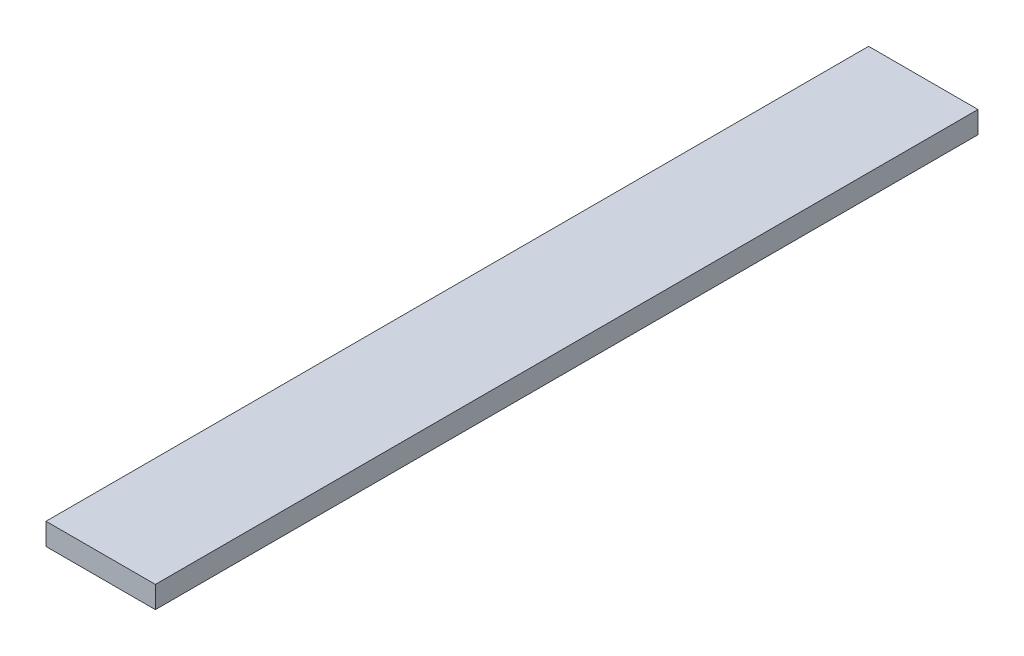
ISO-10303-21;
HEADER;
FILE_DESCRIPTION(('STEP AP214'),'2;1');
FILE_NAME('part.step','',(''),(''),'','','');
FILE_SCHEMA(('AUTOMOTIVE_DESIGN { 1 0 10303 214 1 1 1 1 }'));
ENDSEC;
DATA;
#1=APPLICATION_CONTEXT('core data for automotive mechanical design processes');
#2=APPLICATION_PROTOCOL_DEFINITION('international standard','automotive_design',2000,#1);
#3=PRODUCT_CONTEXT('',#1,'mechanical');
#4=PRODUCT('Part','Part','',(#3));
#5=PRODUCT_RELATED_PRODUCT_CATEGORY('part','',(#4));
#6=PRODUCT_DEFINITION_FORMATION('','',#4);
#7=PRODUCT_DEFINITION_CONTEXT('part definition',#1,'design');
#8=PRODUCT_DEFINITION('design','',#6,#7);
#9=PRODUCT_DEFINITION_SHAPE('','',#8);
#10=(LENGTH_UNIT() NAMED_UNIT(*) SI_UNIT(.MILLI.,.METRE.));
#11=(NAMED_UNIT(*) PLANE_ANGLE_UNIT() SI_UNIT($,.RADIAN.));
#12=(NAMED_UNIT(*) SI_UNIT($,.STERADIAN.) SOLID_ANGLE_UNIT());
#13=UNCERTAINTY_MEASURE_WITH_UNIT(LENGTH_MEASURE(1.E-05),#10,'distance_accuracy_value','');
#14=(GEOMETRIC_REPRESENTATION_CONTEXT(3) GLOBAL_UNCERTAINTY_ASSIGNED_CONTEXT((#13)) GLOBAL_UNIT_ASSIGNED_CONTEXT((#10,
#11,#12)) REPRESENTATION_CONTEXT('',''));
#15=CARTESIAN_POINT('',(0.,0.,0.));
#16=DIRECTION('',(0.,0.,1.));
#17=DIRECTION('',(1.,0.,0.));
#18=AXIS2_PLACEMENT_3D('',#15,#16,#17);
#19=CARTESIAN_POINT('',(0.,2.02999999999,0.));
#20=DIRECTION('',(0.,1.,0.));
#21=DIRECTION('',(-1.,0.,0.));
#22=AXIS2_PLACEMENT_3D('',#19,#20,#21);
#23=PLANE('',#22);
#24=DIRECTION('',(0.,0.,1.));
#25=VECTOR('',#24,1.);
#26=CARTESIAN_POINT('',(0.875,2.02999999999,0.195));
#27=LINE('',#26,#25);
#28=CARTESIAN_POINT('',(0.875,2.02999999999,0.195));
#29=VERTEX_POINT('',#28);
#30=CARTESIAN_POINT('',(0.875,2.02999999999,2.075));
#31=VERTEX_POINT('',#30);
#32=EDGE_CURVE('E80',#29,#31,#27,.T.);
#33=ORIENTED_EDGE('',*,*,#32,.T.);
#34=DIRECTION('',(-1.,0.,0.));
#35=VECTOR('',#34,1.);
#36=CARTESIAN_POINT('',(0.875,2.02999999999,2.075));
#37=LINE('',#36,#35);
#38=CARTESIAN_POINT('',(0.625,2.02999999999,2.075));
#39=VERTEX_POINT('',#38);
#40=EDGE_CURVE('E67',#31,#39,#37,.T.);
#41=ORIENTED_EDGE('',*,*,#40,.T.);
#42=DIRECTION('',(0.,0.,1.));
#43=VECTOR('',#42,1.);
#44=CARTESIAN_POINT('',(0.625,2.02999999999,0.195));
#45=LINE('',#44,#43);
#46=CARTESIAN_POINT('',(0.625,2.02999999999,0.195));
#47=VERTEX_POINT('',#46);
#48=EDGE_CURVE('E54',#39,#47,#45,.F.);
#49=ORIENTED_EDGE('',*,*,#48,.T.);
#50=DIRECTION('',(1.,0.,0.));
#51=VECTOR('',#50,1.);
#52=CARTESIAN_POINT('',(0.875,2.02999999999,0.195));
#53=LINE('',#52,#51);
#54=EDGE_CURVE('E19',#47,#29,#53,.T.);
#55=ORIENTED_EDGE('',*,*,#54,.T.);
#56=EDGE_LOOP('',(#33,#41,#49,#55));
#57=FACE_BOUND('',#56,.T.);
#58=ADVANCED_FACE('F16',(#57),#23,.F.);
#59=CARTESIAN_POINT('',(0.875,2.07999999999,0.195));
#60=DIRECTION('',(0.,0.,1.));
#61=DIRECTION('',(1.,0.,0.));
#62=AXIS2_PLACEMENT_3D('',#59,#60,#61);
#63=PLANE('',#62);
#64=DIRECTION('',(0.,1.,0.));
#65=VECTOR('',#64,1.);
#66=CARTESIAN_POINT('',(0.625,2.07999999999,0.195));
#67=LINE('',#66,#65);
#68=CARTESIAN_POINT('',(0.625,2.07999999999,0.195));
#69=VERTEX_POINT('',#68);
#70=EDGE_CURVE('E60',#47,#69,#67,.T.);
#71=ORIENTED_EDGE('',*,*,#70,.T.);
#72=DIRECTION('',(-1.,0.,0.));
#73=VECTOR('',#72,1.);
#74=CARTESIAN_POINT('',(0.,2.07999999999,0.195));
#75=LINE('',#74,#73);
#76=CARTESIAN_POINT('',(0.875,2.07999999999,0.195));
#77=VERTEX_POINT('',#76);
#78=EDGE_CURVE('E82',#77,#69,#75,.T.);
#79=ORIENTED_EDGE('',*,*,#78,.F.);
#80=DIRECTION('',(0.,-1.,0.));
#81=VECTOR('',#80,1.);
#82=CARTESIAN_POINT('',(0.875,2.07999999999,0.195));
#83=LINE('',#82,#81);
#84=EDGE_CURVE('E63',#77,#29,#83,.T.);
#85=ORIENTED_EDGE('',*,*,#84,.T.);
#86=ORIENTED_EDGE('',*,*,#54,.F.);
#87=EDGE_LOOP('',(#71,#79,#85,#86));
#88=FACE_BOUND('',#87,.T.);
#89=ADVANCED_FACE('F59',(#88),#63,.F.);
#90=CARTESIAN_POINT('',(0.625,2.07999999999,0.195));
#91=DIRECTION('',(1.,0.,0.));
#92=DIRECTION('',(0.,1.,0.));
#93=AXIS2_PLACEMENT_3D('',#90,#91,#92);
#94=PLANE('',#93);
#95=DIRECTION('',(0.,1.,0.));
#96=VECTOR('',#95,1.);
#97=CARTESIAN_POINT('',(0.625,2.07999999999,2.075));
#98=LINE('',#97,#96);
#99=CARTESIAN_POINT('',(0.625,2.07999999999,2.075));
#100=VERTEX_POINT('',#99);
#101=EDGE_CURVE('E69',#39,#100,#98,.T.);
#102=ORIENTED_EDGE('',*,*,#101,.T.);
#103=DIRECTION('',(0.,0.,1.));
#104=VECTOR('',#103,1.);
#105=CARTESIAN_POINT('',(0.625,2.07999999999,0.));
#106=LINE('',#105,#104);
#107=EDGE_CURVE('E73',#69,#100,#106,.T.);
#108=ORIENTED_EDGE('',*,*,#107,.F.);
#109=ORIENTED_EDGE('',*,*,#70,.F.);
#110=ORIENTED_EDGE('',*,*,#48,.F.);
#111=EDGE_LOOP('',(#102,#108,#109,#110));
#112=FACE_BOUND('',#111,.T.);
#113=ADVANCED_FACE('F71',(#112),#94,.F.);
#114=CARTESIAN_POINT('',(0.875,2.07999999999,2.075));
#115=DIRECTION('',(0.,0.,-1.));
#116=DIRECTION('',(-1.,0.,0.));
#117=AXIS2_PLACEMENT_3D('',#114,#115,#116);
#118=PLANE('',#117);
#119=DIRECTION('',(0.,-1.,0.));
#120=VECTOR('',#119,1.);
#121=CARTESIAN_POINT('',(0.875,2.07999999999,2.075));
#122=LINE('',#121,#120);
#123=CARTESIAN_POINT('',(0.875,2.07999999999,2.075));
#124=VERTEX_POINT('',#123);
#125=EDGE_CURVE('E34',#31,#124,#122,.F.);
#126=ORIENTED_EDGE('',*,*,#125,.T.);
#127=DIRECTION('',(-1.,0.,0.));
#128=VECTOR('',#127,1.);
#129=CARTESIAN_POINT('',(0.,2.07999999999,2.075));
#130=LINE('',#129,#128);
#131=EDGE_CURVE('E25',#100,#124,#130,.F.);
#132=ORIENTED_EDGE('',*,*,#131,.F.);
#133=ORIENTED_EDGE('',*,*,#101,.F.);
#134=ORIENTED_EDGE('',*,*,#40,.F.);
#135=EDGE_LOOP('',(#126,#132,#133,#134));
#136=FACE_BOUND('',#135,.T.);
#137=ADVANCED_FACE('F88',(#136),#118,.F.);
#138=CARTESIAN_POINT('',(0.875,2.07999999999,0.195));
#139=DIRECTION('',(-1.,0.,0.));
#140=DIRECTION('',(0.,-1.,0.));
#141=AXIS2_PLACEMENT_3D('',#138,#139,#140);
#142=PLANE('',#141);
#143=ORIENTED_EDGE('',*,*,#84,.F.);
#144=DIRECTION('',(0.,0.,1.));
#145=VECTOR('',#144,1.);
#146=CARTESIAN_POINT('',(0.875,2.07999999999,0.));
#147=LINE('',#146,#145);
#148=EDGE_CURVE('E11',#124,#77,#147,.F.);
#149=ORIENTED_EDGE('',*,*,#148,.F.);
#150=ORIENTED_EDGE('',*,*,#125,.F.);
#151=ORIENTED_EDGE('',*,*,#32,.F.);
#152=EDGE_LOOP('',(#143,#149,#150,#151));
#153=FACE_BOUND('',#152,.T.);
#154=ADVANCED_FACE('F90',(#153),#142,.F.);
#155=CARTESIAN_POINT('',(0.,2.07999999999,0.));
#156=DIRECTION('',(0.,1.,0.));
#157=DIRECTION('',(-1.,0.,0.));
#158=AXIS2_PLACEMENT_3D('',#155,#156,#157);
#159=PLANE('',#158);
#160=ORIENTED_EDGE('',*,*,#131,.T.);
#161=ORIENTED_EDGE('',*,*,#148,.T.);
#162=ORIENTED_EDGE('',*,*,#78,.T.);
#163=ORIENTED_EDGE('',*,*,#107,.T.);
#164=EDGE_LOOP('',(#160,#161,#162,#163));
#165=FACE_BOUND('',#164,.T.);
#166=ADVANCED_FACE('F87',(#165),#159,.T.);
#167=CLOSED_SHELL('',(#58,#89,#113,#137,#154,#166));
#168=MANIFOLD_SOLID_BREP('B1',#167);
#169=ADVANCED_BREP_SHAPE_REPRESENTATION('',(#18,#168),#14);
#170=SHAPE_DEFINITION_REPRESENTATION(#9,#169);
ENDSEC;
END-ISO-10303-21;
